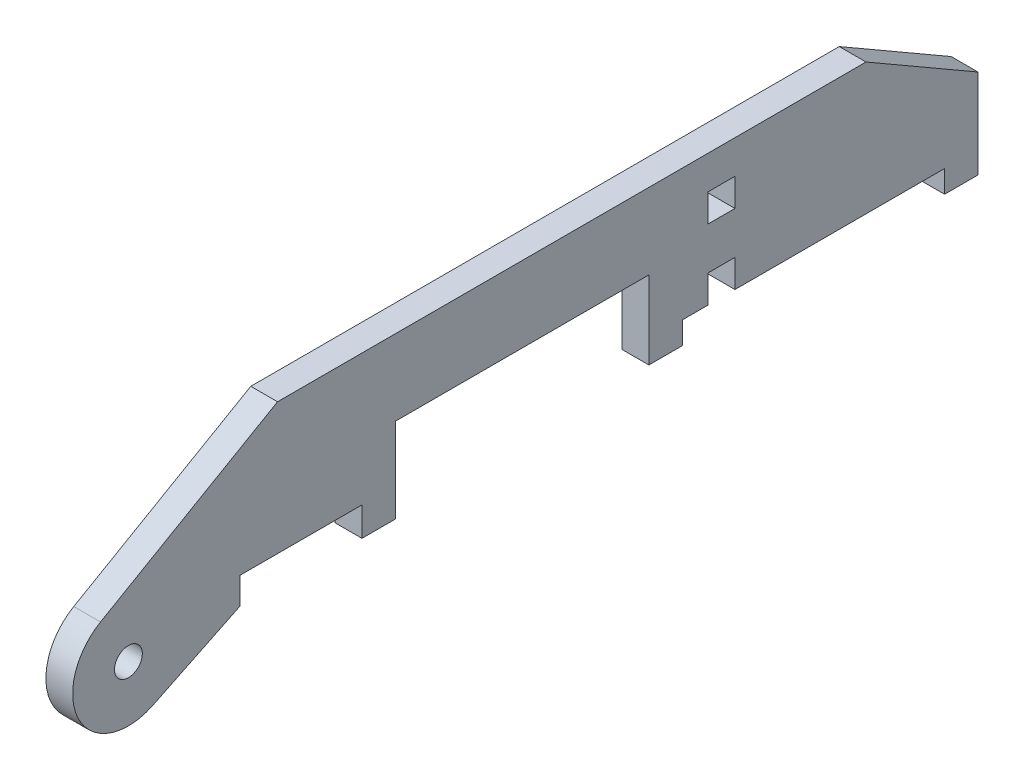
ISO-10303-21;
HEADER;
FILE_DESCRIPTION(('STEP AP214'),'2;1');
FILE_NAME('part.step','',(''),(''),'','','');
FILE_SCHEMA(('AUTOMOTIVE_DESIGN { 1 0 10303 214 1 1 1 1 }'));
ENDSEC;
DATA;
#1=APPLICATION_CONTEXT('core data for automotive mechanical design processes');
#2=APPLICATION_PROTOCOL_DEFINITION('international standard','automotive_design',2000,#1);
#3=PRODUCT_CONTEXT('',#1,'mechanical');
#4=PRODUCT('Part','Part','',(#3));
#5=PRODUCT_RELATED_PRODUCT_CATEGORY('part','',(#4));
#6=PRODUCT_DEFINITION_FORMATION('','',#4);
#7=PRODUCT_DEFINITION_CONTEXT('part definition',#1,'design');
#8=PRODUCT_DEFINITION('design','',#6,#7);
#9=PRODUCT_DEFINITION_SHAPE('','',#8);
#10=(LENGTH_UNIT() NAMED_UNIT(*) SI_UNIT(.MILLI.,.METRE.));
#11=(NAMED_UNIT(*) PLANE_ANGLE_UNIT() SI_UNIT($,.RADIAN.));
#12=(NAMED_UNIT(*) SI_UNIT($,.STERADIAN.) SOLID_ANGLE_UNIT());
#13=UNCERTAINTY_MEASURE_WITH_UNIT(LENGTH_MEASURE(1.E-05),#10,'distance_accuracy_value','');
#14=(GEOMETRIC_REPRESENTATION_CONTEXT(3) GLOBAL_UNCERTAINTY_ASSIGNED_CONTEXT((#13)) GLOBAL_UNIT_ASSIGNED_CONTEXT((#10,
#11,#12)) REPRESENTATION_CONTEXT('',''));
#15=CARTESIAN_POINT('',(0.,0.,0.));
#16=DIRECTION('',(0.,0.,1.));
#17=DIRECTION('',(1.,0.,0.));
#18=AXIS2_PLACEMENT_3D('',#15,#16,#17);
#19=CARTESIAN_POINT('',(3.048,51.3143053538504,147.857292876109));
#20=DIRECTION('',(1.,0.,0.));
#21=DIRECTION('',(0.,0.,-1.));
#22=AXIS2_PLACEMENT_3D('',#19,#20,#21);
#23=PLANE('',#22);
#24=DIRECTION('',(0.,1.,0.));
#25=VECTOR('',#24,1.);
#26=CARTESIAN_POINT('',(3.048,55.626,122.457292876109));
#27=LINE('',#26,#25);
#28=CARTESIAN_POINT('',(3.048,49.53,122.457292876109));
#29=VERTEX_POINT('',#28);
#30=CARTESIAN_POINT('',(3.048,55.626,122.457292876109));
#31=VERTEX_POINT('',#30);
#32=EDGE_CURVE('E257',#29,#31,#27,.T.);
#33=ORIENTED_EDGE('',*,*,#32,.T.);
#34=DIRECTION('',(0.,0.,-1.));
#35=VECTOR('',#34,1.);
#36=CARTESIAN_POINT('',(3.048,55.626,94.6423658094959));
#37=LINE('',#36,#35);
#38=CARTESIAN_POINT('',(3.048,55.626,94.6423658094959));
#39=VERTEX_POINT('',#38);
#40=EDGE_CURVE('E260',#31,#39,#37,.T.);
#41=ORIENTED_EDGE('',*,*,#40,.T.);
#42=DIRECTION('',(0.,-1.,0.));
#43=VECTOR('',#42,1.);
#44=CARTESIAN_POINT('',(3.048,55.626,94.6423658094959));
#45=LINE('',#44,#43);
#46=CARTESIAN_POINT('',(3.048,49.022,94.6423658094959));
#47=VERTEX_POINT('',#46);
#48=EDGE_CURVE('E263',#39,#47,#45,.T.);
#49=ORIENTED_EDGE('',*,*,#48,.T.);
#50=DIRECTION('',(0.,0.,-1.));
#51=VECTOR('',#50,1.);
#52=CARTESIAN_POINT('',(3.048,49.022,87.022365809496));
#53=LINE('',#52,#51);
#54=CARTESIAN_POINT('',(3.048,49.022,87.022365809496));
#55=VERTEX_POINT('',#54);
#56=EDGE_CURVE('E265',#47,#55,#53,.T.);
#57=ORIENTED_EDGE('',*,*,#56,.T.);
#58=DIRECTION('',(0.,1.,0.));
#59=VECTOR('',#58,1.);
#60=CARTESIAN_POINT('',(3.048,49.022,87.022365809496));
#61=LINE('',#60,#59);
#62=CARTESIAN_POINT('',(3.048,68.326,87.022365809496));
#63=VERTEX_POINT('',#62);
#64=EDGE_CURVE('E267',#55,#63,#61,.T.);
#65=ORIENTED_EDGE('',*,*,#64,.T.);
#66=DIRECTION('',(0.,0.,-1.));
#67=VECTOR('',#66,1.);
#68=CARTESIAN_POINT('',(3.048,68.326,87.022365809496));
#69=LINE('',#68,#67);
#70=CARTESIAN_POINT('',(3.048,68.326,29.2718566261337));
#71=VERTEX_POINT('',#70);
#72=EDGE_CURVE('E269',#63,#71,#69,.T.);
#73=ORIENTED_EDGE('',*,*,#72,.T.);
#74=DIRECTION('',(0.,-1.,0.));
#75=VECTOR('',#74,1.);
#76=CARTESIAN_POINT('',(3.048,50.546,29.2718566261337));
#77=LINE('',#76,#75);
#78=CARTESIAN_POINT('',(3.048,50.546,29.2718566261337));
#79=VERTEX_POINT('',#78);
#80=EDGE_CURVE('E271',#71,#79,#77,.T.);
#81=ORIENTED_EDGE('',*,*,#80,.T.);
#82=DIRECTION('',(0.,0.,-1.));
#83=VECTOR('',#82,1.);
#84=CARTESIAN_POINT('',(3.048,50.546,29.2718566261337));
#85=LINE('',#84,#83);
#86=CARTESIAN_POINT('',(3.048,50.546,21.6518566261337));
#87=VERTEX_POINT('',#86);
#88=EDGE_CURVE('E273',#79,#87,#85,.T.);
#89=ORIENTED_EDGE('',*,*,#88,.T.);
#90=DIRECTION('',(0.,1.,0.));
#91=VECTOR('',#90,1.);
#92=CARTESIAN_POINT('',(3.048,55.626,21.6518566261337));
#93=LINE('',#92,#91);
#94=CARTESIAN_POINT('',(3.048,55.626,21.6518566261337));
#95=VERTEX_POINT('',#94);
#96=EDGE_CURVE('E275',#87,#95,#93,.T.);
#97=ORIENTED_EDGE('',*,*,#96,.T.);
#98=DIRECTION('',(0.,0.,-1.));
#99=VECTOR('',#98,1.);
#100=CARTESIAN_POINT('',(3.048,55.626,21.6518566261337));
#101=LINE('',#100,#99);
#102=CARTESIAN_POINT('',(3.048,55.626,15.748));
#103=VERTEX_POINT('',#102);
#104=EDGE_CURVE('E277',#95,#103,#101,.T.);
#105=ORIENTED_EDGE('',*,*,#104,.T.);
#106=DIRECTION('',(0.,1.,0.));
#107=VECTOR('',#106,1.);
#108=CARTESIAN_POINT('',(3.048,55.626,15.748));
#109=LINE('',#108,#107);
#110=CARTESIAN_POINT('',(3.048,61.976,15.748));
#111=VERTEX_POINT('',#110);
#112=EDGE_CURVE('E279',#103,#111,#109,.T.);
#113=ORIENTED_EDGE('',*,*,#112,.T.);
#114=DIRECTION('',(0.,0.,-1.));
#115=VECTOR('',#114,1.);
#116=CARTESIAN_POINT('',(3.048,61.976,15.748));
#117=LINE('',#116,#115);
#118=CARTESIAN_POINT('',(3.048,61.976,9.652));
#119=VERTEX_POINT('',#118);
#120=EDGE_CURVE('E281',#111,#119,#117,.T.);
#121=ORIENTED_EDGE('',*,*,#120,.T.);
#122=DIRECTION('',(0.,-1.,0.));
#123=VECTOR('',#122,1.);
#124=CARTESIAN_POINT('',(3.048,55.626,9.652));
#125=LINE('',#124,#123);
#126=CARTESIAN_POINT('',(3.048,55.626,9.652));
#127=VERTEX_POINT('',#126);
#128=EDGE_CURVE('E283',#119,#127,#125,.T.);
#129=ORIENTED_EDGE('',*,*,#128,.T.);
#130=DIRECTION('',(0.,0.,-1.));
#131=VECTOR('',#130,1.);
#132=CARTESIAN_POINT('',(3.048,55.626,9.652));
#133=LINE('',#132,#131);
#134=CARTESIAN_POINT('',(3.048,55.626,-38.1));
#135=VERTEX_POINT('',#134);
#136=EDGE_CURVE('E285',#127,#135,#133,.T.);
#137=ORIENTED_EDGE('',*,*,#136,.T.);
#138=DIRECTION('',(0.,-1.,0.));
#139=VECTOR('',#138,1.);
#140=CARTESIAN_POINT('',(3.048,55.626,-38.1));
#141=LINE('',#140,#139);
#142=CARTESIAN_POINT('',(3.048,50.546,-38.1));
#143=VERTEX_POINT('',#142);
#144=EDGE_CURVE('E287',#135,#143,#141,.T.);
#145=ORIENTED_EDGE('',*,*,#144,.T.);
#146=DIRECTION('',(0.,0.,-1.));
#147=VECTOR('',#146,1.);
#148=CARTESIAN_POINT('',(3.048,50.546,-45.72));
#149=LINE('',#148,#147);
#150=CARTESIAN_POINT('',(3.048,50.546,-45.72));
#151=VERTEX_POINT('',#150);
#152=EDGE_CURVE('E289',#143,#151,#149,.T.);
#153=ORIENTED_EDGE('',*,*,#152,.T.);
#154=DIRECTION('',(0.,1.,0.));
#155=VECTOR('',#154,1.);
#156=CARTESIAN_POINT('',(3.048,50.546,-45.72));
#157=LINE('',#156,#155);
#158=CARTESIAN_POINT('',(3.048,70.866,-45.72));
#159=VERTEX_POINT('',#158);
#160=EDGE_CURVE('E291',#151,#159,#157,.T.);
#161=ORIENTED_EDGE('',*,*,#160,.T.);
#162=DIRECTION('',(0.,0.500000000000001,0.866025403784438));
#163=VECTOR('',#162,1.);
#164=CARTESIAN_POINT('',(3.048,70.866,-45.72));
#165=LINE('',#164,#163);
#166=CARTESIAN_POINT('',(3.048,85.598,-20.2034275028954));
#167=VERTEX_POINT('',#166);
#168=EDGE_CURVE('E293',#159,#167,#165,.T.);
#169=ORIENTED_EDGE('',*,*,#168,.T.);
#170=DIRECTION('',(0.,0.,1.));
#171=VECTOR('',#170,1.);
#172=CARTESIAN_POINT('',(3.048,85.598,-20.2034275028954));
#173=LINE('',#172,#171);
#174=CARTESIAN_POINT('',(3.048,85.598,113.8761918778));
#175=VERTEX_POINT('',#174);
#176=EDGE_CURVE('E295',#167,#175,#173,.T.);
#177=ORIENTED_EDGE('',*,*,#176,.T.);
#178=DIRECTION('',(0.,-0.499999999999995,0.866025403784441));
#179=VECTOR('',#178,1.);
#180=CARTESIAN_POINT('',(3.048,62.3128279819127,154.207292876109));
#181=LINE('',#180,#179);
#182=CARTESIAN_POINT('',(3.048,62.3128279819127,154.207292876109));
#183=VERTEX_POINT('',#182);
#184=EDGE_CURVE('E297',#175,#183,#181,.T.);
#185=ORIENTED_EDGE('',*,*,#184,.T.);
#186=CARTESIAN_POINT('',(3.048,51.3143053538504,147.857292876109));
#187=DIRECTION('',(1.,0.,0.));
#188=DIRECTION('',(0.,0.,-1.));
#189=AXIS2_PLACEMENT_3D('',#186,#187,#188);
#190=CIRCLE('',#189,12.7);
#191=CARTESIAN_POINT('',(3.048,39.8899589675905,142.309833128914));
#192=VERTEX_POINT('',#191);
#193=EDGE_CURVE('E299',#183,#192,#190,.T.);
#194=ORIENTED_EDGE('',*,*,#193,.T.);
#195=DIRECTION('',(0.,0.436807854109848,-0.899554833563774));
#196=VECTOR('',#195,1.);
#197=CARTESIAN_POINT('',(3.048,49.53,122.457292876109));
#198=LINE('',#197,#196);
#199=EDGE_CURVE('E301',#192,#29,#198,.T.);
#200=ORIENTED_EDGE('',*,*,#199,.T.);
#201=EDGE_LOOP('',(#33,#41,#49,#57,#65,#73,#81,#89,#97,#105,#113,#121,#129,#137,#145,#153,#161,
#169,#177,#185,#194,#200));
#202=FACE_BOUND('',#201,.T.);
#203=CARTESIAN_POINT('',(3.048,51.3143053538504,147.857292876109));
#204=DIRECTION('',(1.,0.,0.));
#205=DIRECTION('',(0.,0.,-1.));
#206=AXIS2_PLACEMENT_3D('',#203,#204,#205);
#207=CIRCLE('',#206,3.17499999999993);
#208=CARTESIAN_POINT('',(3.048,51.3143053538504,144.682292876109));
#209=VERTEX_POINT('',#208);
#210=EDGE_CURVE('E251',#209,#209,#207,.T.);
#211=ORIENTED_EDGE('',*,*,#210,.F.);
#212=EDGE_LOOP('',(#211));
#213=FACE_BOUND('',#212,.T.);
#214=DIRECTION('',(0.,0.,1.));
#215=VECTOR('',#214,1.);
#216=CARTESIAN_POINT('',(3.048,77.978,9.652));
#217=LINE('',#216,#215);
#218=CARTESIAN_POINT('',(3.048,77.978,9.652));
#219=VERTEX_POINT('',#218);
#220=CARTESIAN_POINT('',(3.048,77.978,15.748));
#221=VERTEX_POINT('',#220);
#222=EDGE_CURVE('E223',#219,#221,#217,.T.);
#223=ORIENTED_EDGE('',*,*,#222,.F.);
#224=DIRECTION('',(0.,1.,0.));
#225=VECTOR('',#224,1.);
#226=CARTESIAN_POINT('',(3.048,77.978,9.652));
#227=LINE('',#226,#225);
#228=CARTESIAN_POINT('',(3.048,71.628,9.652));
#229=VERTEX_POINT('',#228);
#230=EDGE_CURVE('E215',#229,#219,#227,.T.);
#231=ORIENTED_EDGE('',*,*,#230,.F.);
#232=DIRECTION('',(0.,0.,-1.));
#233=VECTOR('',#232,1.);
#234=CARTESIAN_POINT('',(3.048,71.628,9.652));
#235=LINE('',#234,#233);
#236=CARTESIAN_POINT('',(3.048,71.628,15.748));
#237=VERTEX_POINT('',#236);
#238=EDGE_CURVE('E237',#237,#229,#235,.T.);
#239=ORIENTED_EDGE('',*,*,#238,.F.);
#240=DIRECTION('',(0.,-1.,0.));
#241=VECTOR('',#240,1.);
#242=CARTESIAN_POINT('',(3.048,77.978,15.748));
#243=LINE('',#242,#241);
#244=EDGE_CURVE('E235',#221,#237,#243,.T.);
#245=ORIENTED_EDGE('',*,*,#244,.F.);
#246=EDGE_LOOP('',(#223,#231,#239,#245));
#247=FACE_BOUND('',#246,.T.);
#248=ADVANCED_FACE('F42',(#202,#213,#247),#23,.T.);
#249=CARTESIAN_POINT('',(-3.048,51.3143053538504,147.857292876109));
#250=DIRECTION('',(1.,0.,0.));
#251=DIRECTION('',(0.,0.,-1.));
#252=AXIS2_PLACEMENT_3D('',#249,#250,#251);
#253=PLANE('',#252);
#254=CARTESIAN_POINT('',(-3.048,51.3143053538504,147.857292876109));
#255=DIRECTION('',(1.,0.,0.));
#256=DIRECTION('',(0.,0.,-1.));
#257=AXIS2_PLACEMENT_3D('',#254,#255,#256);
#258=CIRCLE('',#257,3.17499999999993);
#259=CARTESIAN_POINT('',(-3.048,51.3143053538504,144.682292876109));
#260=VERTEX_POINT('',#259);
#261=EDGE_CURVE('E231',#260,#260,#258,.T.);
#262=ORIENTED_EDGE('',*,*,#261,.T.);
#263=EDGE_LOOP('',(#262));
#264=FACE_BOUND('',#263,.T.);
#265=DIRECTION('',(0.,1.,0.));
#266=VECTOR('',#265,1.);
#267=CARTESIAN_POINT('',(-3.048,55.626,122.457292876109));
#268=LINE('',#267,#266);
#269=CARTESIAN_POINT('',(-3.048,49.53,122.457292876109));
#270=VERTEX_POINT('',#269);
#271=CARTESIAN_POINT('',(-3.048,55.626,122.457292876109));
#272=VERTEX_POINT('',#271);
#273=EDGE_CURVE('E254',#270,#272,#268,.T.);
#274=ORIENTED_EDGE('',*,*,#273,.F.);
#275=DIRECTION('',(0.,0.436807854109848,-0.899554833563774));
#276=VECTOR('',#275,1.);
#277=CARTESIAN_POINT('',(-3.048,49.53,122.457292876109));
#278=LINE('',#277,#276);
#279=CARTESIAN_POINT('',(-3.048,39.8899589675905,142.309833128914));
#280=VERTEX_POINT('',#279);
#281=EDGE_CURVE('E261',#280,#270,#278,.T.);
#282=ORIENTED_EDGE('',*,*,#281,.F.);
#283=CARTESIAN_POINT('',(-3.048,51.3143053538504,147.857292876109));
#284=DIRECTION('',(1.,0.,0.));
#285=DIRECTION('',(0.,0.,-1.));
#286=AXIS2_PLACEMENT_3D('',#283,#284,#285);
#287=CIRCLE('',#286,12.7);
#288=CARTESIAN_POINT('',(-3.048,62.3128279819127,154.207292876109));
#289=VERTEX_POINT('',#288);
#290=EDGE_CURVE('E344',#289,#280,#287,.T.);
#291=ORIENTED_EDGE('',*,*,#290,.F.);
#292=DIRECTION('',(0.,-0.499999999999995,0.866025403784441));
#293=VECTOR('',#292,1.);
#294=CARTESIAN_POINT('',(-3.048,62.3128279819127,154.207292876109));
#295=LINE('',#294,#293);
#296=CARTESIAN_POINT('',(-3.048,85.598,113.8761918778));
#297=VERTEX_POINT('',#296);
#298=EDGE_CURVE('E342',#297,#289,#295,.T.);
#299=ORIENTED_EDGE('',*,*,#298,.F.);
#300=DIRECTION('',(0.,0.,1.));
#301=VECTOR('',#300,1.);
#302=CARTESIAN_POINT('',(-3.048,85.598,-20.2034275028954));
#303=LINE('',#302,#301);
#304=CARTESIAN_POINT('',(-3.048,85.598,-20.2034275028954));
#305=VERTEX_POINT('',#304);
#306=EDGE_CURVE('E340',#305,#297,#303,.T.);
#307=ORIENTED_EDGE('',*,*,#306,.F.);
#308=DIRECTION('',(0.,0.500000000000001,0.866025403784438));
#309=VECTOR('',#308,1.);
#310=CARTESIAN_POINT('',(-3.048,70.866,-45.72));
#311=LINE('',#310,#309);
#312=CARTESIAN_POINT('',(-3.048,70.866,-45.72));
#313=VERTEX_POINT('',#312);
#314=EDGE_CURVE('E338',#313,#305,#311,.T.);
#315=ORIENTED_EDGE('',*,*,#314,.F.);
#316=DIRECTION('',(0.,1.,0.));
#317=VECTOR('',#316,1.);
#318=CARTESIAN_POINT('',(-3.048,50.546,-45.72));
#319=LINE('',#318,#317);
#320=CARTESIAN_POINT('',(-3.048,50.546,-45.72));
#321=VERTEX_POINT('',#320);
#322=EDGE_CURVE('E336',#321,#313,#319,.T.);
#323=ORIENTED_EDGE('',*,*,#322,.F.);
#324=DIRECTION('',(0.,0.,-1.));
#325=VECTOR('',#324,1.);
#326=CARTESIAN_POINT('',(-3.048,50.546,-45.72));
#327=LINE('',#326,#325);
#328=CARTESIAN_POINT('',(-3.048,50.546,-38.1));
#329=VERTEX_POINT('',#328);
#330=EDGE_CURVE('E334',#329,#321,#327,.T.);
#331=ORIENTED_EDGE('',*,*,#330,.F.);
#332=DIRECTION('',(0.,-1.,0.));
#333=VECTOR('',#332,1.);
#334=CARTESIAN_POINT('',(-3.048,55.626,-38.1));
#335=LINE('',#334,#333);
#336=CARTESIAN_POINT('',(-3.048,55.626,-38.1));
#337=VERTEX_POINT('',#336);
#338=EDGE_CURVE('E332',#337,#329,#335,.T.);
#339=ORIENTED_EDGE('',*,*,#338,.F.);
#340=DIRECTION('',(0.,0.,-1.));
#341=VECTOR('',#340,1.);
#342=CARTESIAN_POINT('',(-3.048,55.626,9.652));
#343=LINE('',#342,#341);
#344=CARTESIAN_POINT('',(-3.048,55.626,9.652));
#345=VERTEX_POINT('',#344);
#346=EDGE_CURVE('E330',#345,#337,#343,.T.);
#347=ORIENTED_EDGE('',*,*,#346,.F.);
#348=DIRECTION('',(0.,-1.,0.));
#349=VECTOR('',#348,1.);
#350=CARTESIAN_POINT('',(-3.048,55.626,9.652));
#351=LINE('',#350,#349);
#352=CARTESIAN_POINT('',(-3.048,61.976,9.652));
#353=VERTEX_POINT('',#352);
#354=EDGE_CURVE('E328',#353,#345,#351,.T.);
#355=ORIENTED_EDGE('',*,*,#354,.F.);
#356=DIRECTION('',(0.,0.,-1.));
#357=VECTOR('',#356,1.);
#358=CARTESIAN_POINT('',(-3.048,61.976,15.748));
#359=LINE('',#358,#357);
#360=CARTESIAN_POINT('',(-3.048,61.976,15.748));
#361=VERTEX_POINT('',#360);
#362=EDGE_CURVE('E326',#361,#353,#359,.T.);
#363=ORIENTED_EDGE('',*,*,#362,.F.);
#364=DIRECTION('',(0.,1.,0.));
#365=VECTOR('',#364,1.);
#366=CARTESIAN_POINT('',(-3.048,55.626,15.748));
#367=LINE('',#366,#365);
#368=CARTESIAN_POINT('',(-3.048,55.626,15.748));
#369=VERTEX_POINT('',#368);
#370=EDGE_CURVE('E324',#369,#361,#367,.T.);
#371=ORIENTED_EDGE('',*,*,#370,.F.);
#372=DIRECTION('',(0.,0.,-1.));
#373=VECTOR('',#372,1.);
#374=CARTESIAN_POINT('',(-3.048,55.626,21.6518566261337));
#375=LINE('',#374,#373);
#376=CARTESIAN_POINT('',(-3.048,55.626,21.6518566261337));
#377=VERTEX_POINT('',#376);
#378=EDGE_CURVE('E322',#377,#369,#375,.T.);
#379=ORIENTED_EDGE('',*,*,#378,.F.);
#380=DIRECTION('',(0.,1.,0.));
#381=VECTOR('',#380,1.);
#382=CARTESIAN_POINT('',(-3.048,55.626,21.6518566261337));
#383=LINE('',#382,#381);
#384=CARTESIAN_POINT('',(-3.048,50.546,21.6518566261337));
#385=VERTEX_POINT('',#384);
#386=EDGE_CURVE('E320',#385,#377,#383,.T.);
#387=ORIENTED_EDGE('',*,*,#386,.F.);
#388=DIRECTION('',(0.,0.,-1.));
#389=VECTOR('',#388,1.);
#390=CARTESIAN_POINT('',(-3.048,50.546,29.2718566261337));
#391=LINE('',#390,#389);
#392=CARTESIAN_POINT('',(-3.048,50.546,29.2718566261337));
#393=VERTEX_POINT('',#392);
#394=EDGE_CURVE('E318',#393,#385,#391,.T.);
#395=ORIENTED_EDGE('',*,*,#394,.F.);
#396=DIRECTION('',(0.,-1.,0.));
#397=VECTOR('',#396,1.);
#398=CARTESIAN_POINT('',(-3.048,50.546,29.2718566261337));
#399=LINE('',#398,#397);
#400=CARTESIAN_POINT('',(-3.048,68.326,29.2718566261337));
#401=VERTEX_POINT('',#400);
#402=EDGE_CURVE('E316',#401,#393,#399,.T.);
#403=ORIENTED_EDGE('',*,*,#402,.F.);
#404=DIRECTION('',(0.,0.,-1.));
#405=VECTOR('',#404,1.);
#406=CARTESIAN_POINT('',(-3.048,68.326,87.022365809496));
#407=LINE('',#406,#405);
#408=CARTESIAN_POINT('',(-3.048,68.326,87.022365809496));
#409=VERTEX_POINT('',#408);
#410=EDGE_CURVE('E314',#409,#401,#407,.T.);
#411=ORIENTED_EDGE('',*,*,#410,.F.);
#412=DIRECTION('',(0.,1.,0.));
#413=VECTOR('',#412,1.);
#414=CARTESIAN_POINT('',(-3.048,49.022,87.022365809496));
#415=LINE('',#414,#413);
#416=CARTESIAN_POINT('',(-3.048,49.022,87.022365809496));
#417=VERTEX_POINT('',#416);
#418=EDGE_CURVE('E312',#417,#409,#415,.T.);
#419=ORIENTED_EDGE('',*,*,#418,.F.);
#420=DIRECTION('',(0.,0.,-1.));
#421=VECTOR('',#420,1.);
#422=CARTESIAN_POINT('',(-3.048,49.022,87.022365809496));
#423=LINE('',#422,#421);
#424=CARTESIAN_POINT('',(-3.048,49.022,94.6423658094959));
#425=VERTEX_POINT('',#424);
#426=EDGE_CURVE('E310',#425,#417,#423,.T.);
#427=ORIENTED_EDGE('',*,*,#426,.F.);
#428=DIRECTION('',(0.,-1.,0.));
#429=VECTOR('',#428,1.);
#430=CARTESIAN_POINT('',(-3.048,55.626,94.6423658094959));
#431=LINE('',#430,#429);
#432=CARTESIAN_POINT('',(-3.048,55.626,94.6423658094959));
#433=VERTEX_POINT('',#432);
#434=EDGE_CURVE('E308',#433,#425,#431,.T.);
#435=ORIENTED_EDGE('',*,*,#434,.F.);
#436=DIRECTION('',(0.,0.,-1.));
#437=VECTOR('',#436,1.);
#438=CARTESIAN_POINT('',(-3.048,55.626,94.6423658094959));
#439=LINE('',#438,#437);
#440=EDGE_CURVE('E306',#272,#433,#439,.T.);
#441=ORIENTED_EDGE('',*,*,#440,.F.);
#442=EDGE_LOOP('',(#274,#282,#291,#299,#307,#315,#323,#331,#339,#347,#355,#363,#371,#379,#387,
#395,#403,#411,#419,#427,#435,#441));
#443=FACE_BOUND('',#442,.T.);
#444=DIRECTION('',(0.,1.,0.));
#445=VECTOR('',#444,1.);
#446=CARTESIAN_POINT('',(-3.048,77.978,9.652));
#447=LINE('',#446,#445);
#448=CARTESIAN_POINT('',(-3.048,71.628,9.65199999999999));
#449=VERTEX_POINT('',#448);
#450=CARTESIAN_POINT('',(-3.048,77.978,9.652));
#451=VERTEX_POINT('',#450);
#452=EDGE_CURVE('E65',#449,#451,#447,.T.);
#453=ORIENTED_EDGE('',*,*,#452,.T.);
#454=DIRECTION('',(0.,0.,1.));
#455=VECTOR('',#454,1.);
#456=CARTESIAN_POINT('',(-3.048,77.978,9.652));
#457=LINE('',#456,#455);
#458=CARTESIAN_POINT('',(-3.048,77.978,15.748));
#459=VERTEX_POINT('',#458);
#460=EDGE_CURVE('E230',#451,#459,#457,.T.);
#461=ORIENTED_EDGE('',*,*,#460,.T.);
#462=DIRECTION('',(0.,-1.,0.));
#463=VECTOR('',#462,1.);
#464=CARTESIAN_POINT('',(-3.048,77.978,15.748));
#465=LINE('',#464,#463);
#466=CARTESIAN_POINT('',(-3.048,71.628,15.748));
#467=VERTEX_POINT('',#466);
#468=EDGE_CURVE('E243',#459,#467,#465,.T.);
#469=ORIENTED_EDGE('',*,*,#468,.T.);
#470=DIRECTION('',(0.,0.,-1.));
#471=VECTOR('',#470,1.);
#472=CARTESIAN_POINT('',(-3.048,71.628,9.652));
#473=LINE('',#472,#471);
#474=EDGE_CURVE('E224',#467,#449,#473,.T.);
#475=ORIENTED_EDGE('',*,*,#474,.T.);
#476=EDGE_LOOP('',(#453,#461,#469,#475));
#477=FACE_BOUND('',#476,.T.);
#478=ADVANCED_FACE('F416',(#264,#443,#477),#253,.F.);
#479=CARTESIAN_POINT('',(3.048,55.626,122.457292876109));
#480=DIRECTION('',(0.,0.,1.));
#481=DIRECTION('',(1.,0.,0.));
#482=AXIS2_PLACEMENT_3D('',#479,#480,#481);
#483=PLANE('',#482);
#484=ORIENTED_EDGE('',*,*,#273,.T.);
#485=DIRECTION('',(-1.,0.,0.));
#486=VECTOR('',#485,1.);
#487=CARTESIAN_POINT('',(3.048,55.626,122.457292876109));
#488=LINE('',#487,#486);
#489=EDGE_CURVE('E13',#31,#272,#488,.T.);
#490=ORIENTED_EDGE('',*,*,#489,.F.);
#491=ORIENTED_EDGE('',*,*,#32,.F.);
#492=DIRECTION('',(-1.,0.,0.));
#493=VECTOR('',#492,1.);
#494=CARTESIAN_POINT('',(3.048,49.53,122.457292876109));
#495=LINE('',#494,#493);
#496=EDGE_CURVE('E303',#29,#270,#495,.T.);
#497=ORIENTED_EDGE('',*,*,#496,.T.);
#498=EDGE_LOOP('',(#484,#490,#491,#497));
#499=FACE_BOUND('',#498,.T.);
#500=ADVANCED_FACE('F44',(#499),#483,.F.);
#501=CARTESIAN_POINT('',(3.048,55.626,94.6423658094959));
#502=DIRECTION('',(0.,1.,0.));
#503=DIRECTION('',(0.,0.,1.));
#504=AXIS2_PLACEMENT_3D('',#501,#502,#503);
#505=PLANE('',#504);
#506=ORIENTED_EDGE('',*,*,#440,.T.);
#507=DIRECTION('',(-1.,0.,0.));
#508=VECTOR('',#507,1.);
#509=CARTESIAN_POINT('',(3.048,55.626,94.6423658094959));
#510=LINE('',#509,#508);
#511=EDGE_CURVE('E50',#39,#433,#510,.T.);
#512=ORIENTED_EDGE('',*,*,#511,.F.);
#513=ORIENTED_EDGE('',*,*,#40,.F.);
#514=ORIENTED_EDGE('',*,*,#489,.T.);
#515=EDGE_LOOP('',(#506,#512,#513,#514));
#516=FACE_BOUND('',#515,.T.);
#517=ADVANCED_FACE('F434',(#516),#505,.F.);
#518=CARTESIAN_POINT('',(3.048,55.626,94.6423658094959));
#519=DIRECTION('',(0.,0.,-1.));
#520=DIRECTION('',(-1.,0.,0.));
#521=AXIS2_PLACEMENT_3D('',#518,#519,#520);
#522=PLANE('',#521);
#523=ORIENTED_EDGE('',*,*,#434,.T.);
#524=DIRECTION('',(-1.,0.,0.));
#525=VECTOR('',#524,1.);
#526=CARTESIAN_POINT('',(3.048,49.022,94.6423658094959));
#527=LINE('',#526,#525);
#528=EDGE_CURVE('E403',#47,#425,#527,.T.);
#529=ORIENTED_EDGE('',*,*,#528,.F.);
#530=ORIENTED_EDGE('',*,*,#48,.F.);
#531=ORIENTED_EDGE('',*,*,#511,.T.);
#532=EDGE_LOOP('',(#523,#529,#530,#531));
#533=FACE_BOUND('',#532,.T.);
#534=ADVANCED_FACE('F410',(#533),#522,.F.);
#535=CARTESIAN_POINT('',(3.048,49.022,87.022365809496));
#536=DIRECTION('',(0.,1.,0.));
#537=DIRECTION('',(0.,0.,1.));
#538=AXIS2_PLACEMENT_3D('',#535,#536,#537);
#539=PLANE('',#538);
#540=ORIENTED_EDGE('',*,*,#426,.T.);
#541=DIRECTION('',(-1.,0.,0.));
#542=VECTOR('',#541,1.);
#543=CARTESIAN_POINT('',(3.048,49.022,87.022365809496));
#544=LINE('',#543,#542);
#545=EDGE_CURVE('E400',#55,#417,#544,.T.);
#546=ORIENTED_EDGE('',*,*,#545,.F.);
#547=ORIENTED_EDGE('',*,*,#56,.F.);
#548=ORIENTED_EDGE('',*,*,#528,.T.);
#549=EDGE_LOOP('',(#540,#546,#547,#548));
#550=FACE_BOUND('',#549,.T.);
#551=ADVANCED_FACE('F422',(#550),#539,.F.);
#552=CARTESIAN_POINT('',(3.048,49.022,87.022365809496));
#553=DIRECTION('',(0.,0.,1.));
#554=DIRECTION('',(1.,0.,0.));
#555=AXIS2_PLACEMENT_3D('',#552,#553,#554);
#556=PLANE('',#555);
#557=ORIENTED_EDGE('',*,*,#418,.T.);
#558=DIRECTION('',(-1.,0.,0.));
#559=VECTOR('',#558,1.);
#560=CARTESIAN_POINT('',(3.048,68.326,87.022365809496));
#561=LINE('',#560,#559);
#562=EDGE_CURVE('E397',#63,#409,#561,.T.);
#563=ORIENTED_EDGE('',*,*,#562,.F.);
#564=ORIENTED_EDGE('',*,*,#64,.F.);
#565=ORIENTED_EDGE('',*,*,#545,.T.);
#566=EDGE_LOOP('',(#557,#563,#564,#565));
#567=FACE_BOUND('',#566,.T.);
#568=ADVANCED_FACE('F426',(#567),#556,.F.);
#569=CARTESIAN_POINT('',(3.048,68.326,87.022365809496));
#570=DIRECTION('',(0.,1.,0.));
#571=DIRECTION('',(0.,0.,1.));
#572=AXIS2_PLACEMENT_3D('',#569,#570,#571);
#573=PLANE('',#572);
#574=ORIENTED_EDGE('',*,*,#410,.T.);
#575=DIRECTION('',(-1.,0.,0.));
#576=VECTOR('',#575,1.);
#577=CARTESIAN_POINT('',(3.048,68.326,29.2718566261337));
#578=LINE('',#577,#576);
#579=EDGE_CURVE('E394',#71,#401,#578,.T.);
#580=ORIENTED_EDGE('',*,*,#579,.F.);
#581=ORIENTED_EDGE('',*,*,#72,.F.);
#582=ORIENTED_EDGE('',*,*,#562,.T.);
#583=EDGE_LOOP('',(#574,#580,#581,#582));
#584=FACE_BOUND('',#583,.T.);
#585=ADVANCED_FACE('F517',(#584),#573,.F.);
#586=CARTESIAN_POINT('',(3.048,50.546,29.2718566261337));
#587=DIRECTION('',(0.,0.,-1.));
#588=DIRECTION('',(-1.,0.,0.));
#589=AXIS2_PLACEMENT_3D('',#586,#587,#588);
#590=PLANE('',#589);
#591=ORIENTED_EDGE('',*,*,#402,.T.);
#592=DIRECTION('',(-1.,0.,0.));
#593=VECTOR('',#592,1.);
#594=CARTESIAN_POINT('',(3.048,50.546,29.2718566261337));
#595=LINE('',#594,#593);
#596=EDGE_CURVE('E391',#79,#393,#595,.T.);
#597=ORIENTED_EDGE('',*,*,#596,.F.);
#598=ORIENTED_EDGE('',*,*,#80,.F.);
#599=ORIENTED_EDGE('',*,*,#579,.T.);
#600=EDGE_LOOP('',(#591,#597,#598,#599));
#601=FACE_BOUND('',#600,.T.);
#602=ADVANCED_FACE('F514',(#601),#590,.F.);
#603=CARTESIAN_POINT('',(3.048,50.546,29.2718566261337));
#604=DIRECTION('',(0.,1.,0.));
#605=DIRECTION('',(0.,0.,1.));
#606=AXIS2_PLACEMENT_3D('',#603,#604,#605);
#607=PLANE('',#606);
#608=ORIENTED_EDGE('',*,*,#394,.T.);
#609=DIRECTION('',(-1.,0.,0.));
#610=VECTOR('',#609,1.);
#611=CARTESIAN_POINT('',(3.048,50.546,21.6518566261337));
#612=LINE('',#611,#610);
#613=EDGE_CURVE('E388',#87,#385,#612,.T.);
#614=ORIENTED_EDGE('',*,*,#613,.F.);
#615=ORIENTED_EDGE('',*,*,#88,.F.);
#616=ORIENTED_EDGE('',*,*,#596,.T.);
#617=EDGE_LOOP('',(#608,#614,#615,#616));
#618=FACE_BOUND('',#617,.T.);
#619=ADVANCED_FACE('F510',(#618),#607,.F.);
#620=CARTESIAN_POINT('',(3.048,55.626,21.6518566261337));
#621=DIRECTION('',(0.,0.,1.));
#622=DIRECTION('',(1.,0.,0.));
#623=AXIS2_PLACEMENT_3D('',#620,#621,#622);
#624=PLANE('',#623);
#625=ORIENTED_EDGE('',*,*,#386,.T.);
#626=DIRECTION('',(-1.,0.,0.));
#627=VECTOR('',#626,1.);
#628=CARTESIAN_POINT('',(3.048,55.626,21.6518566261337));
#629=LINE('',#628,#627);
#630=EDGE_CURVE('E385',#95,#377,#629,.T.);
#631=ORIENTED_EDGE('',*,*,#630,.F.);
#632=ORIENTED_EDGE('',*,*,#96,.F.);
#633=ORIENTED_EDGE('',*,*,#613,.T.);
#634=EDGE_LOOP('',(#625,#631,#632,#633));
#635=FACE_BOUND('',#634,.T.);
#636=ADVANCED_FACE('F506',(#635),#624,.F.);
#637=CARTESIAN_POINT('',(3.048,55.626,21.6518566261337));
#638=DIRECTION('',(0.,1.,0.));
#639=DIRECTION('',(0.,0.,1.));
#640=AXIS2_PLACEMENT_3D('',#637,#638,#639);
#641=PLANE('',#640);
#642=ORIENTED_EDGE('',*,*,#378,.T.);
#643=DIRECTION('',(-1.,0.,0.));
#644=VECTOR('',#643,1.);
#645=CARTESIAN_POINT('',(3.048,55.626,15.748));
#646=LINE('',#645,#644);
#647=EDGE_CURVE('E382',#103,#369,#646,.T.);
#648=ORIENTED_EDGE('',*,*,#647,.F.);
#649=ORIENTED_EDGE('',*,*,#104,.F.);
#650=ORIENTED_EDGE('',*,*,#630,.T.);
#651=EDGE_LOOP('',(#642,#648,#649,#650));
#652=FACE_BOUND('',#651,.T.);
#653=ADVANCED_FACE('F501',(#652),#641,.F.);
#654=CARTESIAN_POINT('',(3.048,55.626,15.748));
#655=DIRECTION('',(0.,0.,1.));
#656=DIRECTION('',(1.,0.,0.));
#657=AXIS2_PLACEMENT_3D('',#654,#655,#656);
#658=PLANE('',#657);
#659=ORIENTED_EDGE('',*,*,#370,.T.);
#660=DIRECTION('',(-1.,0.,0.));
#661=VECTOR('',#660,1.);
#662=CARTESIAN_POINT('',(3.048,61.976,15.748));
#663=LINE('',#662,#661);
#664=EDGE_CURVE('E379',#111,#361,#663,.T.);
#665=ORIENTED_EDGE('',*,*,#664,.F.);
#666=ORIENTED_EDGE('',*,*,#112,.F.);
#667=ORIENTED_EDGE('',*,*,#647,.T.);
#668=EDGE_LOOP('',(#659,#665,#666,#667));
#669=FACE_BOUND('',#668,.T.);
#670=ADVANCED_FACE('F495',(#669),#658,.F.);
#671=CARTESIAN_POINT('',(3.048,61.976,15.748));
#672=DIRECTION('',(0.,1.,0.));
#673=DIRECTION('',(0.,0.,1.));
#674=AXIS2_PLACEMENT_3D('',#671,#672,#673);
#675=PLANE('',#674);
#676=ORIENTED_EDGE('',*,*,#362,.T.);
#677=DIRECTION('',(-1.,0.,0.));
#678=VECTOR('',#677,1.);
#679=CARTESIAN_POINT('',(3.048,61.976,9.652));
#680=LINE('',#679,#678);
#681=EDGE_CURVE('E376',#119,#353,#680,.T.);
#682=ORIENTED_EDGE('',*,*,#681,.F.);
#683=ORIENTED_EDGE('',*,*,#120,.F.);
#684=ORIENTED_EDGE('',*,*,#664,.T.);
#685=EDGE_LOOP('',(#676,#682,#683,#684));
#686=FACE_BOUND('',#685,.T.);
#687=ADVANCED_FACE('F491',(#686),#675,.F.);
#688=CARTESIAN_POINT('',(3.048,55.626,9.652));
#689=DIRECTION('',(0.,0.,-1.));
#690=DIRECTION('',(-1.,0.,0.));
#691=AXIS2_PLACEMENT_3D('',#688,#689,#690);
#692=PLANE('',#691);
#693=ORIENTED_EDGE('',*,*,#354,.T.);
#694=DIRECTION('',(-1.,0.,0.));
#695=VECTOR('',#694,1.);
#696=CARTESIAN_POINT('',(3.048,55.626,9.652));
#697=LINE('',#696,#695);
#698=EDGE_CURVE('E373',#127,#345,#697,.T.);
#699=ORIENTED_EDGE('',*,*,#698,.F.);
#700=ORIENTED_EDGE('',*,*,#128,.F.);
#701=ORIENTED_EDGE('',*,*,#681,.T.);
#702=EDGE_LOOP('',(#693,#699,#700,#701));
#703=FACE_BOUND('',#702,.T.);
#704=ADVANCED_FACE('F486',(#703),#692,.F.);
#705=CARTESIAN_POINT('',(3.048,55.626,9.652));
#706=DIRECTION('',(0.,1.,0.));
#707=DIRECTION('',(0.,0.,1.));
#708=AXIS2_PLACEMENT_3D('',#705,#706,#707);
#709=PLANE('',#708);
#710=ORIENTED_EDGE('',*,*,#346,.T.);
#711=DIRECTION('',(-1.,0.,0.));
#712=VECTOR('',#711,1.);
#713=CARTESIAN_POINT('',(3.048,55.626,-38.1));
#714=LINE('',#713,#712);
#715=EDGE_CURVE('E370',#135,#337,#714,.T.);
#716=ORIENTED_EDGE('',*,*,#715,.F.);
#717=ORIENTED_EDGE('',*,*,#136,.F.);
#718=ORIENTED_EDGE('',*,*,#698,.T.);
#719=EDGE_LOOP('',(#710,#716,#717,#718));
#720=FACE_BOUND('',#719,.T.);
#721=ADVANCED_FACE('F480',(#720),#709,.F.);
#722=CARTESIAN_POINT('',(3.048,55.626,-38.1));
#723=DIRECTION('',(0.,0.,-1.));
#724=DIRECTION('',(0.,1.,0.));
#725=AXIS2_PLACEMENT_3D('',#722,#723,#724);
#726=PLANE('',#725);
#727=ORIENTED_EDGE('',*,*,#338,.T.);
#728=DIRECTION('',(-1.,0.,0.));
#729=VECTOR('',#728,1.);
#730=CARTESIAN_POINT('',(3.048,50.546,-38.1));
#731=LINE('',#730,#729);
#732=EDGE_CURVE('E367',#143,#329,#731,.T.);
#733=ORIENTED_EDGE('',*,*,#732,.F.);
#734=ORIENTED_EDGE('',*,*,#144,.F.);
#735=ORIENTED_EDGE('',*,*,#715,.T.);
#736=EDGE_LOOP('',(#727,#733,#734,#735));
#737=FACE_BOUND('',#736,.T.);
#738=ADVANCED_FACE('F476',(#737),#726,.F.);
#739=CARTESIAN_POINT('',(3.048,50.546,-45.72));
#740=DIRECTION('',(0.,1.,0.));
#741=DIRECTION('',(0.,0.,1.));
#742=AXIS2_PLACEMENT_3D('',#739,#740,#741);
#743=PLANE('',#742);
#744=ORIENTED_EDGE('',*,*,#330,.T.);
#745=DIRECTION('',(-1.,0.,0.));
#746=VECTOR('',#745,1.);
#747=CARTESIAN_POINT('',(3.048,50.546,-45.72));
#748=LINE('',#747,#746);
#749=EDGE_CURVE('E364',#151,#321,#748,.T.);
#750=ORIENTED_EDGE('',*,*,#749,.F.);
#751=ORIENTED_EDGE('',*,*,#152,.F.);
#752=ORIENTED_EDGE('',*,*,#732,.T.);
#753=EDGE_LOOP('',(#744,#750,#751,#752));
#754=FACE_BOUND('',#753,.T.);
#755=ADVANCED_FACE('F471',(#754),#743,.F.);
#756=CARTESIAN_POINT('',(3.048,50.546,-45.72));
#757=DIRECTION('',(0.,0.,1.));
#758=DIRECTION('',(0.,-1.,0.));
#759=AXIS2_PLACEMENT_3D('',#756,#757,#758);
#760=PLANE('',#759);
#761=ORIENTED_EDGE('',*,*,#322,.T.);
#762=DIRECTION('',(-1.,0.,0.));
#763=VECTOR('',#762,1.);
#764=CARTESIAN_POINT('',(3.048,70.866,-45.72));
#765=LINE('',#764,#763);
#766=EDGE_CURVE('E361',#159,#313,#765,.T.);
#767=ORIENTED_EDGE('',*,*,#766,.F.);
#768=ORIENTED_EDGE('',*,*,#160,.F.);
#769=ORIENTED_EDGE('',*,*,#749,.T.);
#770=EDGE_LOOP('',(#761,#767,#768,#769));
#771=FACE_BOUND('',#770,.T.);
#772=ADVANCED_FACE('F465',(#771),#760,.F.);
#773=CARTESIAN_POINT('',(3.048,70.866,-45.72));
#774=DIRECTION('',(0.,-0.866025403784438,0.500000000000001));
#775=DIRECTION('',(0.,-0.500000000000001,-0.866025403784438));
#776=AXIS2_PLACEMENT_3D('',#773,#774,#775);
#777=PLANE('',#776);
#778=ORIENTED_EDGE('',*,*,#314,.T.);
#779=DIRECTION('',(-1.,0.,0.));
#780=VECTOR('',#779,1.);
#781=CARTESIAN_POINT('',(3.048,85.598,-20.2034275028954));
#782=LINE('',#781,#780);
#783=EDGE_CURVE('E358',#167,#305,#782,.T.);
#784=ORIENTED_EDGE('',*,*,#783,.F.);
#785=ORIENTED_EDGE('',*,*,#168,.F.);
#786=ORIENTED_EDGE('',*,*,#766,.T.);
#787=EDGE_LOOP('',(#778,#784,#785,#786));
#788=FACE_BOUND('',#787,.T.);
#789=ADVANCED_FACE('F461',(#788),#777,.F.);
#790=CARTESIAN_POINT('',(3.048,85.598,-20.2034275028954));
#791=DIRECTION('',(0.,-1.,0.));
#792=DIRECTION('',(0.,0.,-1.));
#793=AXIS2_PLACEMENT_3D('',#790,#791,#792);
#794=PLANE('',#793);
#795=ORIENTED_EDGE('',*,*,#306,.T.);
#796=DIRECTION('',(-1.,0.,0.));
#797=VECTOR('',#796,1.);
#798=CARTESIAN_POINT('',(3.048,85.598,113.8761918778));
#799=LINE('',#798,#797);
#800=EDGE_CURVE('E355',#175,#297,#799,.T.);
#801=ORIENTED_EDGE('',*,*,#800,.F.);
#802=ORIENTED_EDGE('',*,*,#176,.F.);
#803=ORIENTED_EDGE('',*,*,#783,.T.);
#804=EDGE_LOOP('',(#795,#801,#802,#803));
#805=FACE_BOUND('',#804,.T.);
#806=ADVANCED_FACE('F456',(#805),#794,.F.);
#807=CARTESIAN_POINT('',(3.048,62.3128279819127,154.207292876109));
#808=DIRECTION('',(0.,-0.866025403784441,-0.499999999999995));
#809=DIRECTION('',(0.,0.499999999999995,-0.866025403784441));
#810=AXIS2_PLACEMENT_3D('',#807,#808,#809);
#811=PLANE('',#810);
#812=ORIENTED_EDGE('',*,*,#298,.T.);
#813=DIRECTION('',(-1.,0.,0.));
#814=VECTOR('',#813,1.);
#815=CARTESIAN_POINT('',(3.048,62.3128279819127,154.207292876109));
#816=LINE('',#815,#814);
#817=EDGE_CURVE('E352',#183,#289,#816,.T.);
#818=ORIENTED_EDGE('',*,*,#817,.F.);
#819=ORIENTED_EDGE('',*,*,#184,.F.);
#820=ORIENTED_EDGE('',*,*,#800,.T.);
#821=EDGE_LOOP('',(#812,#818,#819,#820));
#822=FACE_BOUND('',#821,.T.);
#823=ADVANCED_FACE('F450',(#822),#811,.F.);
#824=CARTESIAN_POINT('',(3.048,51.3143053538504,147.857292876109));
#825=DIRECTION('',(-1.,0.,0.));
#826=DIRECTION('',(0.,0.,1.));
#827=AXIS2_PLACEMENT_3D('',#824,#825,#826);
#828=CYLINDRICAL_SURFACE('',#827,12.7);
#829=ORIENTED_EDGE('',*,*,#290,.T.);
#830=DIRECTION('',(-1.,0.,0.));
#831=VECTOR('',#830,1.);
#832=CARTESIAN_POINT('',(3.048,39.8899589675905,142.309833128914));
#833=LINE('',#832,#831);
#834=EDGE_CURVE('E349',#192,#280,#833,.T.);
#835=ORIENTED_EDGE('',*,*,#834,.F.);
#836=ORIENTED_EDGE('',*,*,#193,.F.);
#837=ORIENTED_EDGE('',*,*,#817,.T.);
#838=EDGE_LOOP('',(#829,#835,#836,#837));
#839=FACE_BOUND('',#838,.T.);
#840=ADVANCED_FACE('F446',(#839),#828,.T.);
#841=CARTESIAN_POINT('',(3.048,49.53,122.457292876109));
#842=DIRECTION('',(0.,0.899554833563774,0.436807854109848));
#843=DIRECTION('',(0.,-0.436807854109848,0.899554833563774));
#844=AXIS2_PLACEMENT_3D('',#841,#842,#843);
#845=PLANE('',#844);
#846=ORIENTED_EDGE('',*,*,#281,.T.);
#847=ORIENTED_EDGE('',*,*,#496,.F.);
#848=ORIENTED_EDGE('',*,*,#199,.F.);
#849=ORIENTED_EDGE('',*,*,#834,.T.);
#850=EDGE_LOOP('',(#846,#847,#848,#849));
#851=FACE_BOUND('',#850,.T.);
#852=ADVANCED_FACE('F441',(#851),#845,.F.);
#853=CARTESIAN_POINT('',(3.048,51.3143053538504,147.857292876109));
#854=DIRECTION('',(-1.,0.,0.));
#855=DIRECTION('',(0.,0.,1.));
#856=AXIS2_PLACEMENT_3D('',#853,#854,#855);
#857=CYLINDRICAL_SURFACE('',#856,3.17499999999993);
#858=ORIENTED_EDGE('',*,*,#210,.T.);
#859=EDGE_LOOP('',(#858));
#860=FACE_BOUND('',#859,.T.);
#861=ORIENTED_EDGE('',*,*,#261,.F.);
#862=EDGE_LOOP('',(#861));
#863=FACE_BOUND('',#862,.T.);
#864=ADVANCED_FACE('F534',(#860,#863),#857,.F.);
#865=CARTESIAN_POINT('',(3.048,77.978,9.652));
#866=DIRECTION('',(0.,0.,1.));
#867=DIRECTION('',(0.,-1.,0.));
#868=AXIS2_PLACEMENT_3D('',#865,#866,#867);
#869=PLANE('',#868);
#870=ORIENTED_EDGE('',*,*,#452,.F.);
#871=DIRECTION('',(-1.,0.,0.));
#872=VECTOR('',#871,1.);
#873=CARTESIAN_POINT('',(3.048,71.628,9.652));
#874=LINE('',#873,#872);
#875=EDGE_CURVE('E219',#229,#449,#874,.T.);
#876=ORIENTED_EDGE('',*,*,#875,.F.);
#877=ORIENTED_EDGE('',*,*,#230,.T.);
#878=DIRECTION('',(-1.,0.,0.));
#879=VECTOR('',#878,1.);
#880=CARTESIAN_POINT('',(3.048,77.978,9.652));
#881=LINE('',#880,#879);
#882=EDGE_CURVE('E218',#219,#451,#881,.T.);
#883=ORIENTED_EDGE('',*,*,#882,.T.);
#884=EDGE_LOOP('',(#870,#876,#877,#883));
#885=FACE_BOUND('',#884,.T.);
#886=ADVANCED_FACE('F217',(#885),#869,.T.);
#887=CARTESIAN_POINT('',(3.048,77.978,9.652));
#888=DIRECTION('',(0.,-1.,0.));
#889=DIRECTION('',(0.,0.,-1.));
#890=AXIS2_PLACEMENT_3D('',#887,#888,#889);
#891=PLANE('',#890);
#892=ORIENTED_EDGE('',*,*,#460,.F.);
#893=ORIENTED_EDGE('',*,*,#882,.F.);
#894=ORIENTED_EDGE('',*,*,#222,.T.);
#895=DIRECTION('',(-1.,0.,0.));
#896=VECTOR('',#895,1.);
#897=CARTESIAN_POINT('',(3.048,77.978,15.748));
#898=LINE('',#897,#896);
#899=EDGE_CURVE('E232',#221,#459,#898,.T.);
#900=ORIENTED_EDGE('',*,*,#899,.T.);
#901=EDGE_LOOP('',(#892,#893,#894,#900));
#902=FACE_BOUND('',#901,.T.);
#903=ADVANCED_FACE('F227',(#902),#891,.T.);
#904=CARTESIAN_POINT('',(3.048,77.978,15.748));
#905=DIRECTION('',(0.,0.,-1.));
#906=DIRECTION('',(-1.,0.,0.));
#907=AXIS2_PLACEMENT_3D('',#904,#905,#906);
#908=PLANE('',#907);
#909=ORIENTED_EDGE('',*,*,#468,.F.);
#910=ORIENTED_EDGE('',*,*,#899,.F.);
#911=ORIENTED_EDGE('',*,*,#244,.T.);
#912=DIRECTION('',(-1.,0.,0.));
#913=VECTOR('',#912,1.);
#914=CARTESIAN_POINT('',(3.048,71.628,15.748));
#915=LINE('',#914,#913);
#916=EDGE_CURVE('E57',#237,#467,#915,.T.);
#917=ORIENTED_EDGE('',*,*,#916,.T.);
#918=EDGE_LOOP('',(#909,#910,#911,#917));
#919=FACE_BOUND('',#918,.T.);
#920=ADVANCED_FACE('F643',(#919),#908,.T.);
#921=CARTESIAN_POINT('',(3.048,71.628,9.652));
#922=DIRECTION('',(0.,1.,0.));
#923=DIRECTION('',(0.,0.,1.));
#924=AXIS2_PLACEMENT_3D('',#921,#922,#923);
#925=PLANE('',#924);
#926=ORIENTED_EDGE('',*,*,#474,.F.);
#927=ORIENTED_EDGE('',*,*,#916,.F.);
#928=ORIENTED_EDGE('',*,*,#238,.T.);
#929=ORIENTED_EDGE('',*,*,#875,.T.);
#930=EDGE_LOOP('',(#926,#927,#928,#929));
#931=FACE_BOUND('',#930,.T.);
#932=ADVANCED_FACE('F650',(#931),#925,.T.);
#933=CLOSED_SHELL('',(#248,#478,#500,#517,#534,#551,#568,#585,#602,#619,#636,#653,#670,#687,
#704,#721,#738,#755,#772,#789,#806,#823,#840,#852,#864,#886,#903,#920,#932));
#934=MANIFOLD_SOLID_BREP('B2',#933);
#935=ADVANCED_BREP_SHAPE_REPRESENTATION('',(#18,#934),#14);
#936=SHAPE_DEFINITION_REPRESENTATION(#9,#935);
ENDSEC;
END-ISO-10303-21;
